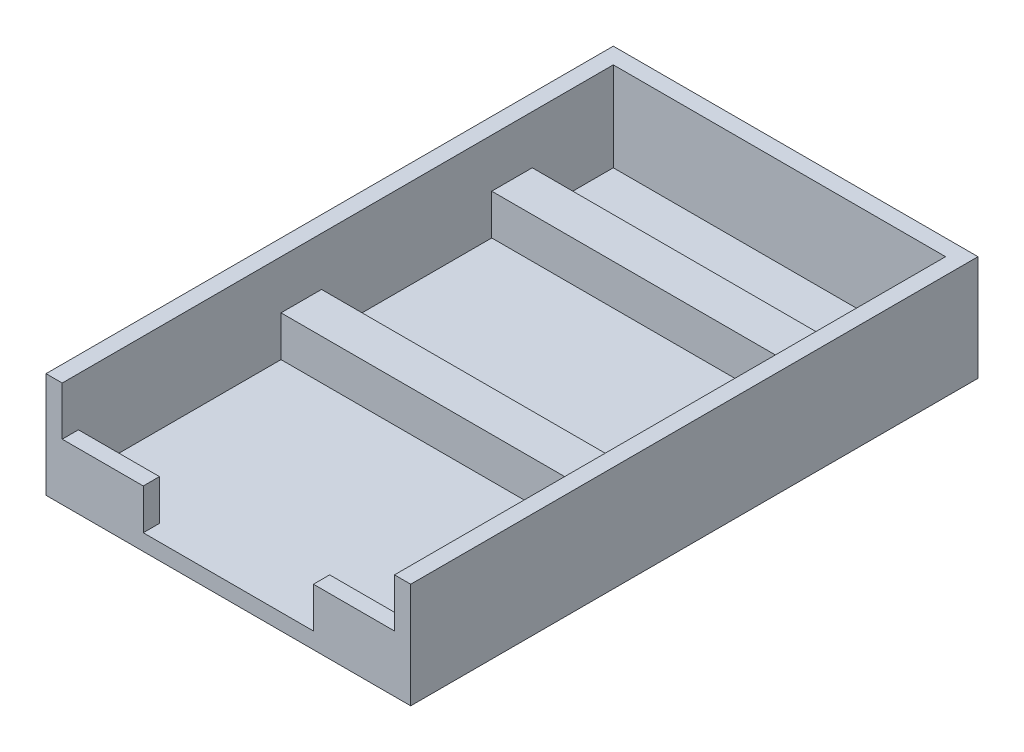
ISO-10303-21;
HEADER;
FILE_DESCRIPTION(('STEP AP214'),'2;1');
FILE_NAME('part.step','',(''),(''),'','','');
FILE_SCHEMA(('AUTOMOTIVE_DESIGN { 1 0 10303 214 1 1 1 1 }'));
ENDSEC;
DATA;
#1=APPLICATION_CONTEXT('core data for automotive mechanical design processes');
#2=APPLICATION_PROTOCOL_DEFINITION('international standard','automotive_design',2000,#1);
#3=PRODUCT_CONTEXT('',#1,'mechanical');
#4=PRODUCT('Part','Part','',(#3));
#5=PRODUCT_RELATED_PRODUCT_CATEGORY('part','',(#4));
#6=PRODUCT_DEFINITION_FORMATION('','',#4);
#7=PRODUCT_DEFINITION_CONTEXT('part definition',#1,'design');
#8=PRODUCT_DEFINITION('design','',#6,#7);
#9=PRODUCT_DEFINITION_SHAPE('','',#8);
#10=(LENGTH_UNIT() NAMED_UNIT(*) SI_UNIT(.MILLI.,.METRE.));
#11=(NAMED_UNIT(*) PLANE_ANGLE_UNIT() SI_UNIT($,.RADIAN.));
#12=(NAMED_UNIT(*) SI_UNIT($,.STERADIAN.) SOLID_ANGLE_UNIT());
#13=UNCERTAINTY_MEASURE_WITH_UNIT(LENGTH_MEASURE(1.E-05),#10,'distance_accuracy_value','');
#14=(GEOMETRIC_REPRESENTATION_CONTEXT(3) GLOBAL_UNCERTAINTY_ASSIGNED_CONTEXT((#13)) GLOBAL_UNIT_ASSIGNED_CONTEXT((#10,
#11,#12)) REPRESENTATION_CONTEXT('',''));
#15=CARTESIAN_POINT('',(0.,0.,0.));
#16=DIRECTION('',(0.,0.,1.));
#17=DIRECTION('',(1.,0.,0.));
#18=AXIS2_PLACEMENT_3D('',#15,#16,#17);
#19=CARTESIAN_POINT('',(-20.5,2.,-33.));
#20=DIRECTION('',(-1.,0.,0.));
#21=DIRECTION('',(0.,0.,1.));
#22=AXIS2_PLACEMENT_3D('',#19,#20,#21);
#23=PLANE('',#22);
#24=DIRECTION('',(0.,1.,0.));
#25=VECTOR('',#24,1.);
#26=CARTESIAN_POINT('',(-20.5,2.,-33.));
#27=LINE('',#26,#25);
#28=CARTESIAN_POINT('',(-20.5,2.,-33.));
#29=VERTEX_POINT('',#28);
#30=CARTESIAN_POINT('',(-20.5,13.,-33.));
#31=VERTEX_POINT('',#30);
#32=EDGE_CURVE('E337',#29,#31,#27,.T.);
#33=ORIENTED_EDGE('',*,*,#32,.T.);
#34=DIRECTION('',(0.,0.,-1.));
#35=VECTOR('',#34,1.);
#36=CARTESIAN_POINT('',(-20.5,13.,-35.));
#37=LINE('',#36,#35);
#38=CARTESIAN_POINT('',(-20.5,13.,35.));
#39=VERTEX_POINT('',#38);
#40=EDGE_CURVE('E232',#39,#31,#37,.T.);
#41=ORIENTED_EDGE('',*,*,#40,.F.);
#42=DIRECTION('',(0.,-1.,0.));
#43=VECTOR('',#42,1.);
#44=CARTESIAN_POINT('',(-20.5,10.,35.));
#45=LINE('',#44,#43);
#46=CARTESIAN_POINT('',(-20.5,7.,35.));
#47=VERTEX_POINT('',#46);
#48=EDGE_CURVE('E206',#39,#47,#45,.T.);
#49=ORIENTED_EDGE('',*,*,#48,.T.);
#50=DIRECTION('',(0.,0.,1.));
#51=VECTOR('',#50,1.);
#52=CARTESIAN_POINT('',(-20.5,7.,32.));
#53=LINE('',#52,#51);
#54=CARTESIAN_POINT('',(-20.5,7.,33.));
#55=VERTEX_POINT('',#54);
#56=EDGE_CURVE('E301',#55,#47,#53,.T.);
#57=ORIENTED_EDGE('',*,*,#56,.F.);
#58=DIRECTION('',(0.,1.,0.));
#59=VECTOR('',#58,1.);
#60=CARTESIAN_POINT('',(-20.5,2.,33.));
#61=LINE('',#60,#59);
#62=CARTESIAN_POINT('',(-20.5,2.,33.));
#63=VERTEX_POINT('',#62);
#64=EDGE_CURVE('E334',#63,#55,#61,.T.);
#65=ORIENTED_EDGE('',*,*,#64,.F.);
#66=DIRECTION('',(0.,0.,1.));
#67=VECTOR('',#66,1.);
#68=CARTESIAN_POINT('',(-20.5,2.,-33.));
#69=LINE('',#68,#67);
#70=CARTESIAN_POINT('',(-20.5,2.,7.99999999999999));
#71=VERTEX_POINT('',#70);
#72=EDGE_CURVE('E321',#71,#63,#69,.T.);
#73=ORIENTED_EDGE('',*,*,#72,.F.);
#74=DIRECTION('',(0.,-1.,0.));
#75=VECTOR('',#74,1.);
#76=CARTESIAN_POINT('',(-20.5,6.99999999999997,7.99999999999999));
#77=LINE('',#76,#75);
#78=CARTESIAN_POINT('',(-20.5,6.99999999999997,7.99999999999999));
#79=VERTEX_POINT('',#78);
#80=EDGE_CURVE('E64',#79,#71,#77,.T.);
#81=ORIENTED_EDGE('',*,*,#80,.F.);
#82=DIRECTION('',(0.,0.,1.));
#83=VECTOR('',#82,1.);
#84=CARTESIAN_POINT('',(-20.5,6.99999999999997,0.));
#85=LINE('',#84,#83);
#86=CARTESIAN_POINT('',(-20.5,6.99999999999997,2.99999999999999));
#87=VERTEX_POINT('',#86);
#88=EDGE_CURVE('E265',#87,#79,#85,.T.);
#89=ORIENTED_EDGE('',*,*,#88,.F.);
#90=DIRECTION('',(0.,-1.,0.));
#91=VECTOR('',#90,1.);
#92=CARTESIAN_POINT('',(-20.5,6.99999999999997,2.99999999999999));
#93=LINE('',#92,#91);
#94=CARTESIAN_POINT('',(-20.5,2.,2.99999999999999));
#95=VERTEX_POINT('',#94);
#96=EDGE_CURVE('E281',#87,#95,#93,.T.);
#97=ORIENTED_EDGE('',*,*,#96,.T.);
#98=CARTESIAN_POINT('',(-20.5,2.,-18.));
#99=VERTEX_POINT('',#98);
#100=EDGE_CURVE('E326',#99,#95,#69,.T.);
#101=ORIENTED_EDGE('',*,*,#100,.F.);
#102=DIRECTION('',(0.,-1.,0.));
#103=VECTOR('',#102,1.);
#104=CARTESIAN_POINT('',(-20.5,6.99999999999997,-18.));
#105=LINE('',#104,#103);
#106=CARTESIAN_POINT('',(-20.5,6.99999999999997,-18.));
#107=VERTEX_POINT('',#106);
#108=EDGE_CURVE('E56',#107,#99,#105,.T.);
#109=ORIENTED_EDGE('',*,*,#108,.F.);
#110=DIRECTION('',(0.,0.,1.));
#111=VECTOR('',#110,1.);
#112=CARTESIAN_POINT('',(-20.5,6.99999999999997,0.));
#113=LINE('',#112,#111);
#114=CARTESIAN_POINT('',(-20.5,6.99999999999997,-23.));
#115=VERTEX_POINT('',#114);
#116=EDGE_CURVE('E245',#115,#107,#113,.T.);
#117=ORIENTED_EDGE('',*,*,#116,.F.);
#118=DIRECTION('',(0.,-1.,0.));
#119=VECTOR('',#118,1.);
#120=CARTESIAN_POINT('',(-20.5,6.99999999999997,-23.));
#121=LINE('',#120,#119);
#122=CARTESIAN_POINT('',(-20.5,2.,-23.));
#123=VERTEX_POINT('',#122);
#124=EDGE_CURVE('E256',#115,#123,#121,.T.);
#125=ORIENTED_EDGE('',*,*,#124,.T.);
#126=EDGE_CURVE('E322',#29,#123,#69,.T.);
#127=ORIENTED_EDGE('',*,*,#126,.F.);
#128=EDGE_LOOP('',(#33,#41,#49,#57,#65,#73,#81,#89,#97,#101,#109,#117,#125,#127));
#129=FACE_BOUND('',#128,.T.);
#130=ADVANCED_FACE('F41',(#129),#23,.F.);
#131=CARTESIAN_POINT('',(0.,2.,0.));
#132=DIRECTION('',(0.,1.,0.));
#133=DIRECTION('',(0.,0.,1.));
#134=AXIS2_PLACEMENT_3D('',#131,#132,#133);
#135=PLANE('',#134);
#136=DIRECTION('',(0.,0.,-1.));
#137=VECTOR('',#136,1.);
#138=CARTESIAN_POINT('',(20.5,2.,-33.));
#139=LINE('',#138,#137);
#140=CARTESIAN_POINT('',(20.5,2.,2.99999999999999));
#141=VERTEX_POINT('',#140);
#142=CARTESIAN_POINT('',(20.5,2.,-18.));
#143=VERTEX_POINT('',#142);
#144=EDGE_CURVE('E318',#141,#143,#139,.T.);
#145=ORIENTED_EDGE('',*,*,#144,.T.);
#146=DIRECTION('',(1.,0.,0.));
#147=VECTOR('',#146,1.);
#148=CARTESIAN_POINT('',(0.,2.,-18.));
#149=LINE('',#148,#147);
#150=EDGE_CURVE('E242',#99,#143,#149,.T.);
#151=ORIENTED_EDGE('',*,*,#150,.F.);
#152=ORIENTED_EDGE('',*,*,#100,.T.);
#153=DIRECTION('',(1.,0.,0.));
#154=VECTOR('',#153,1.);
#155=CARTESIAN_POINT('',(0.,2.,2.99999999999999));
#156=LINE('',#155,#154);
#157=EDGE_CURVE('E261',#95,#141,#156,.T.);
#158=ORIENTED_EDGE('',*,*,#157,.T.);
#159=EDGE_LOOP('',(#145,#151,#152,#158));
#160=FACE_BOUND('',#159,.T.);
#161=ADVANCED_FACE('F379',(#160),#135,.T.);
#162=CARTESIAN_POINT('',(20.5,2.,33.));
#163=VERTEX_POINT('',#162);
#164=CARTESIAN_POINT('',(20.5,2.,7.99999999999999));
#165=VERTEX_POINT('',#164);
#166=EDGE_CURVE('E314',#163,#165,#139,.T.);
#167=ORIENTED_EDGE('',*,*,#166,.T.);
#168=DIRECTION('',(1.,0.,0.));
#169=VECTOR('',#168,1.);
#170=CARTESIAN_POINT('',(0.,2.,7.99999999999999));
#171=LINE('',#170,#169);
#172=EDGE_CURVE('E266',#71,#165,#171,.T.);
#173=ORIENTED_EDGE('',*,*,#172,.F.);
#174=ORIENTED_EDGE('',*,*,#72,.T.);
#175=DIRECTION('',(1.,0.,0.));
#176=VECTOR('',#175,1.);
#177=CARTESIAN_POINT('',(-20.5,2.,33.));
#178=LINE('',#177,#176);
#179=CARTESIAN_POINT('',(-10.5,2.,33.));
#180=VERTEX_POINT('',#179);
#181=EDGE_CURVE('E327',#63,#180,#178,.T.);
#182=ORIENTED_EDGE('',*,*,#181,.T.);
#183=DIRECTION('',(0.,0.,-1.));
#184=VECTOR('',#183,1.);
#185=CARTESIAN_POINT('',(-10.5,2.,75.));
#186=LINE('',#185,#184);
#187=CARTESIAN_POINT('',(-10.5,2.,35.));
#188=VERTEX_POINT('',#187);
#189=EDGE_CURVE('E290',#188,#180,#186,.T.);
#190=ORIENTED_EDGE('',*,*,#189,.F.);
#191=DIRECTION('',(-1.,0.,0.));
#192=VECTOR('',#191,1.);
#193=CARTESIAN_POINT('',(-22.5,2.,35.));
#194=LINE('',#193,#192);
#195=CARTESIAN_POINT('',(10.5,2.,35.));
#196=VERTEX_POINT('',#195);
#197=EDGE_CURVE('E298',#196,#188,#194,.T.);
#198=ORIENTED_EDGE('',*,*,#197,.F.);
#199=DIRECTION('',(0.,0.,-1.));
#200=VECTOR('',#199,1.);
#201=CARTESIAN_POINT('',(10.5,2.,75.));
#202=LINE('',#201,#200);
#203=CARTESIAN_POINT('',(10.5,2.,33.));
#204=VERTEX_POINT('',#203);
#205=EDGE_CURVE('E289',#196,#204,#202,.T.);
#206=ORIENTED_EDGE('',*,*,#205,.T.);
#207=EDGE_CURVE('E325',#204,#163,#178,.T.);
#208=ORIENTED_EDGE('',*,*,#207,.T.);
#209=EDGE_LOOP('',(#167,#173,#174,#182,#190,#198,#206,#208));
#210=FACE_BOUND('',#209,.T.);
#211=ADVANCED_FACE('F374',(#210),#135,.T.);
#212=CARTESIAN_POINT('',(-22.5,10.,35.));
#213=DIRECTION('',(0.,0.,-1.));
#214=DIRECTION('',(-1.,0.,0.));
#215=AXIS2_PLACEMENT_3D('',#212,#213,#214);
#216=PLANE('',#215);
#217=DIRECTION('',(0.,1.,0.));
#218=VECTOR('',#217,1.);
#219=CARTESIAN_POINT('',(10.5,10.,35.));
#220=LINE('',#219,#218);
#221=CARTESIAN_POINT('',(10.5,7.,35.));
#222=VERTEX_POINT('',#221);
#223=EDGE_CURVE('E296',#196,#222,#220,.T.);
#224=ORIENTED_EDGE('',*,*,#223,.F.);
#225=ORIENTED_EDGE('',*,*,#197,.T.);
#226=DIRECTION('',(0.,1.,0.));
#227=VECTOR('',#226,1.);
#228=CARTESIAN_POINT('',(-10.5,10.,35.));
#229=LINE('',#228,#227);
#230=CARTESIAN_POINT('',(-10.5,7.,35.));
#231=VERTEX_POINT('',#230);
#232=EDGE_CURVE('E292',#188,#231,#229,.T.);
#233=ORIENTED_EDGE('',*,*,#232,.T.);
#234=DIRECTION('',(1.,0.,0.));
#235=VECTOR('',#234,1.);
#236=CARTESIAN_POINT('',(-22.5,7.,35.));
#237=LINE('',#236,#235);
#238=EDGE_CURVE('E310',#47,#231,#237,.T.);
#239=ORIENTED_EDGE('',*,*,#238,.F.);
#240=ORIENTED_EDGE('',*,*,#48,.F.);
#241=DIRECTION('',(1.,0.,0.));
#242=VECTOR('',#241,1.);
#243=CARTESIAN_POINT('',(-22.5,13.,35.));
#244=LINE('',#243,#242);
#245=CARTESIAN_POINT('',(-22.5,13.,35.));
#246=VERTEX_POINT('',#245);
#247=EDGE_CURVE('E229',#246,#39,#244,.T.);
#248=ORIENTED_EDGE('',*,*,#247,.F.);
#249=DIRECTION('',(0.,-1.,0.));
#250=VECTOR('',#249,1.);
#251=CARTESIAN_POINT('',(-22.5,10.,35.));
#252=LINE('',#251,#250);
#253=CARTESIAN_POINT('',(-22.5,0.,35.));
#254=VERTEX_POINT('',#253);
#255=EDGE_CURVE('E349',#246,#254,#252,.T.);
#256=ORIENTED_EDGE('',*,*,#255,.T.);
#257=DIRECTION('',(1.,0.,0.));
#258=VECTOR('',#257,1.);
#259=CARTESIAN_POINT('',(-22.5,0.,35.));
#260=LINE('',#259,#258);
#261=CARTESIAN_POINT('',(22.5,0.,35.));
#262=VERTEX_POINT('',#261);
#263=EDGE_CURVE('E333',#254,#262,#260,.T.);
#264=ORIENTED_EDGE('',*,*,#263,.T.);
#265=DIRECTION('',(0.,-1.,0.));
#266=VECTOR('',#265,1.);
#267=CARTESIAN_POINT('',(22.5,10.,35.));
#268=LINE('',#267,#266);
#269=CARTESIAN_POINT('',(22.5,13.,35.));
#270=VERTEX_POINT('',#269);
#271=EDGE_CURVE('E221',#270,#262,#268,.T.);
#272=ORIENTED_EDGE('',*,*,#271,.F.);
#273=DIRECTION('',(1.,0.,0.));
#274=VECTOR('',#273,1.);
#275=CARTESIAN_POINT('',(20.5,13.,35.));
#276=LINE('',#275,#274);
#277=CARTESIAN_POINT('',(20.5,13.,35.));
#278=VERTEX_POINT('',#277);
#279=EDGE_CURVE('E213',#278,#270,#276,.T.);
#280=ORIENTED_EDGE('',*,*,#279,.F.);
#281=DIRECTION('',(0.,1.,0.));
#282=VECTOR('',#281,1.);
#283=CARTESIAN_POINT('',(20.5,10.,35.));
#284=LINE('',#283,#282);
#285=CARTESIAN_POINT('',(20.5,7.,35.));
#286=VERTEX_POINT('',#285);
#287=EDGE_CURVE('E193',#286,#278,#284,.T.);
#288=ORIENTED_EDGE('',*,*,#287,.F.);
#289=EDGE_CURVE('E309',#222,#286,#237,.T.);
#290=ORIENTED_EDGE('',*,*,#289,.F.);
#291=EDGE_LOOP('',(#224,#225,#233,#239,#240,#248,#256,#264,#272,#280,#288,#290));
#292=FACE_BOUND('',#291,.T.);
#293=ADVANCED_FACE('F43',(#292),#216,.F.);
#294=CARTESIAN_POINT('',(-20.5,2.,33.));
#295=DIRECTION('',(0.,0.,1.));
#296=DIRECTION('',(1.,0.,0.));
#297=AXIS2_PLACEMENT_3D('',#294,#295,#296);
#298=PLANE('',#297);
#299=DIRECTION('',(0.,1.,0.));
#300=VECTOR('',#299,1.);
#301=CARTESIAN_POINT('',(10.5,0.,33.));
#302=LINE('',#301,#300);
#303=CARTESIAN_POINT('',(10.5,7.,33.));
#304=VERTEX_POINT('',#303);
#305=EDGE_CURVE('E284',#204,#304,#302,.T.);
#306=ORIENTED_EDGE('',*,*,#305,.T.);
#307=DIRECTION('',(-1.,0.,0.));
#308=VECTOR('',#307,1.);
#309=CARTESIAN_POINT('',(-20.5,7.,33.));
#310=LINE('',#309,#308);
#311=CARTESIAN_POINT('',(20.5,7.,33.));
#312=VERTEX_POINT('',#311);
#313=EDGE_CURVE('E306',#312,#304,#310,.T.);
#314=ORIENTED_EDGE('',*,*,#313,.F.);
#315=DIRECTION('',(0.,1.,0.));
#316=VECTOR('',#315,1.);
#317=CARTESIAN_POINT('',(20.5,2.,33.));
#318=LINE('',#317,#316);
#319=EDGE_CURVE('E331',#163,#312,#318,.T.);
#320=ORIENTED_EDGE('',*,*,#319,.F.);
#321=ORIENTED_EDGE('',*,*,#207,.F.);
#322=EDGE_LOOP('',(#306,#314,#320,#321));
#323=FACE_BOUND('',#322,.T.);
#324=ADVANCED_FACE('F446',(#323),#298,.F.);
#325=CARTESIAN_POINT('',(0.,7.,32.));
#326=DIRECTION('',(0.,1.,0.));
#327=DIRECTION('',(0.,0.,1.));
#328=AXIS2_PLACEMENT_3D('',#325,#326,#327);
#329=PLANE('',#328);
#330=ORIENTED_EDGE('',*,*,#313,.T.);
#331=DIRECTION('',(0.,0.,1.));
#332=VECTOR('',#331,1.);
#333=CARTESIAN_POINT('',(10.5,7.,32.));
#334=LINE('',#333,#332);
#335=EDGE_CURVE('E11',#304,#222,#334,.T.);
#336=ORIENTED_EDGE('',*,*,#335,.T.);
#337=ORIENTED_EDGE('',*,*,#289,.T.);
#338=DIRECTION('',(0.,0.,1.));
#339=VECTOR('',#338,1.);
#340=CARTESIAN_POINT('',(20.5,7.,32.));
#341=LINE('',#340,#339);
#342=EDGE_CURVE('E201',#312,#286,#341,.T.);
#343=ORIENTED_EDGE('',*,*,#342,.F.);
#344=EDGE_LOOP('',(#330,#336,#337,#343));
#345=FACE_BOUND('',#344,.T.);
#346=ADVANCED_FACE('F445',(#345),#329,.T.);
#347=CARTESIAN_POINT('',(-10.5,7.,33.));
#348=VERTEX_POINT('',#347);
#349=EDGE_CURVE('E305',#348,#55,#310,.T.);
#350=ORIENTED_EDGE('',*,*,#349,.F.);
#351=DIRECTION('',(0.,1.,0.));
#352=VECTOR('',#351,1.);
#353=CARTESIAN_POINT('',(-10.5,0.,33.));
#354=LINE('',#353,#352);
#355=EDGE_CURVE('E287',#180,#348,#354,.T.);
#356=ORIENTED_EDGE('',*,*,#355,.F.);
#357=ORIENTED_EDGE('',*,*,#181,.F.);
#358=ORIENTED_EDGE('',*,*,#64,.T.);
#359=EDGE_LOOP('',(#350,#356,#357,#358));
#360=FACE_BOUND('',#359,.T.);
#361=ADVANCED_FACE('F372',(#360),#298,.F.);
#362=CARTESIAN_POINT('',(22.5,10.,-35.));
#363=DIRECTION('',(1.,0.,0.));
#364=DIRECTION('',(0.,0.,-1.));
#365=AXIS2_PLACEMENT_3D('',#362,#363,#364);
#366=PLANE('',#365);
#367=DIRECTION('',(0.,0.,1.));
#368=VECTOR('',#367,1.);
#369=CARTESIAN_POINT('',(22.5,0.,-35.));
#370=LINE('',#369,#368);
#371=CARTESIAN_POINT('',(22.5,0.,-35.));
#372=VERTEX_POINT('',#371);
#373=EDGE_CURVE('E341',#372,#262,#370,.T.);
#374=ORIENTED_EDGE('',*,*,#373,.F.);
#375=DIRECTION('',(0.,-1.,0.));
#376=VECTOR('',#375,1.);
#377=CARTESIAN_POINT('',(22.5,10.,-35.));
#378=LINE('',#377,#376);
#379=CARTESIAN_POINT('',(22.5,13.,-35.));
#380=VERTEX_POINT('',#379);
#381=EDGE_CURVE('E354',#380,#372,#378,.T.);
#382=ORIENTED_EDGE('',*,*,#381,.F.);
#383=DIRECTION('',(0.,0.,-1.));
#384=VECTOR('',#383,1.);
#385=CARTESIAN_POINT('',(22.5,13.,-35.));
#386=LINE('',#385,#384);
#387=EDGE_CURVE('E222',#270,#380,#386,.T.);
#388=ORIENTED_EDGE('',*,*,#387,.F.);
#389=ORIENTED_EDGE('',*,*,#271,.T.);
#390=EDGE_LOOP('',(#374,#382,#388,#389));
#391=FACE_BOUND('',#390,.T.);
#392=ADVANCED_FACE('F438',(#391),#366,.T.);
#393=CARTESIAN_POINT('',(-22.5,10.,-35.));
#394=DIRECTION('',(0.,0.,-1.));
#395=DIRECTION('',(-1.,0.,0.));
#396=AXIS2_PLACEMENT_3D('',#393,#394,#395);
#397=PLANE('',#396);
#398=DIRECTION('',(-1.,0.,0.));
#399=VECTOR('',#398,1.);
#400=CARTESIAN_POINT('',(-22.5,13.,-35.));
#401=LINE('',#400,#399);
#402=CARTESIAN_POINT('',(-22.5,13.,-35.));
#403=VERTEX_POINT('',#402);
#404=EDGE_CURVE('E234',#380,#403,#401,.T.);
#405=ORIENTED_EDGE('',*,*,#404,.F.);
#406=ORIENTED_EDGE('',*,*,#381,.T.);
#407=DIRECTION('',(1.,0.,0.));
#408=VECTOR('',#407,1.);
#409=CARTESIAN_POINT('',(-22.5,0.,-35.));
#410=LINE('',#409,#408);
#411=CARTESIAN_POINT('',(-22.5,0.,-35.));
#412=VERTEX_POINT('',#411);
#413=EDGE_CURVE('E344',#412,#372,#410,.T.);
#414=ORIENTED_EDGE('',*,*,#413,.F.);
#415=DIRECTION('',(0.,-1.,0.));
#416=VECTOR('',#415,1.);
#417=CARTESIAN_POINT('',(-22.5,10.,-35.));
#418=LINE('',#417,#416);
#419=EDGE_CURVE('E352',#403,#412,#418,.T.);
#420=ORIENTED_EDGE('',*,*,#419,.F.);
#421=EDGE_LOOP('',(#405,#406,#414,#420));
#422=FACE_BOUND('',#421,.T.);
#423=ADVANCED_FACE('F435',(#422),#397,.T.);
#424=CARTESIAN_POINT('',(-22.5,10.,-35.));
#425=DIRECTION('',(1.,0.,0.));
#426=DIRECTION('',(0.,0.,-1.));
#427=AXIS2_PLACEMENT_3D('',#424,#425,#426);
#428=PLANE('',#427);
#429=DIRECTION('',(0.,0.,1.));
#430=VECTOR('',#429,1.);
#431=CARTESIAN_POINT('',(-22.5,0.,-35.));
#432=LINE('',#431,#430);
#433=EDGE_CURVE('E347',#412,#254,#432,.T.);
#434=ORIENTED_EDGE('',*,*,#433,.T.);
#435=ORIENTED_EDGE('',*,*,#255,.F.);
#436=DIRECTION('',(0.,0.,1.));
#437=VECTOR('',#436,1.);
#438=CARTESIAN_POINT('',(-22.5,13.,-35.));
#439=LINE('',#438,#437);
#440=EDGE_CURVE('E227',#403,#246,#439,.T.);
#441=ORIENTED_EDGE('',*,*,#440,.F.);
#442=ORIENTED_EDGE('',*,*,#419,.T.);
#443=EDGE_LOOP('',(#434,#435,#441,#442));
#444=FACE_BOUND('',#443,.T.);
#445=ADVANCED_FACE('F432',(#444),#428,.F.);
#446=CARTESIAN_POINT('',(0.,0.,0.));
#447=DIRECTION('',(0.,-1.,0.));
#448=DIRECTION('',(0.,0.,-1.));
#449=AXIS2_PLACEMENT_3D('',#446,#447,#448);
#450=PLANE('',#449);
#451=ORIENTED_EDGE('',*,*,#263,.F.);
#452=ORIENTED_EDGE('',*,*,#433,.F.);
#453=ORIENTED_EDGE('',*,*,#413,.T.);
#454=ORIENTED_EDGE('',*,*,#373,.T.);
#455=EDGE_LOOP('',(#451,#452,#453,#454));
#456=FACE_BOUND('',#455,.T.);
#457=ADVANCED_FACE('F429',(#456),#450,.T.);
#458=CARTESIAN_POINT('',(20.5,2.,-33.));
#459=DIRECTION('',(1.,0.,0.));
#460=DIRECTION('',(0.,0.,-1.));
#461=AXIS2_PLACEMENT_3D('',#458,#459,#460);
#462=PLANE('',#461);
#463=CARTESIAN_POINT('',(20.5,2.,-23.));
#464=VERTEX_POINT('',#463);
#465=CARTESIAN_POINT('',(20.5,2.,-33.));
#466=VERTEX_POINT('',#465);
#467=EDGE_CURVE('E205',#464,#466,#139,.T.);
#468=ORIENTED_EDGE('',*,*,#467,.F.);
#469=DIRECTION('',(0.,-1.,0.));
#470=VECTOR('',#469,1.);
#471=CARTESIAN_POINT('',(20.5,6.99999999999997,-23.));
#472=LINE('',#471,#470);
#473=CARTESIAN_POINT('',(20.5,6.99999999999997,-23.));
#474=VERTEX_POINT('',#473);
#475=EDGE_CURVE('E259',#474,#464,#472,.T.);
#476=ORIENTED_EDGE('',*,*,#475,.F.);
#477=DIRECTION('',(0.,0.,1.));
#478=VECTOR('',#477,1.);
#479=CARTESIAN_POINT('',(20.5,6.99999999999997,0.));
#480=LINE('',#479,#478);
#481=CARTESIAN_POINT('',(20.5,6.99999999999997,-18.));
#482=VERTEX_POINT('',#481);
#483=EDGE_CURVE('E238',#474,#482,#480,.T.);
#484=ORIENTED_EDGE('',*,*,#483,.T.);
#485=DIRECTION('',(0.,-1.,0.));
#486=VECTOR('',#485,1.);
#487=CARTESIAN_POINT('',(20.5,6.99999999999997,-18.));
#488=LINE('',#487,#486);
#489=EDGE_CURVE('E249',#482,#143,#488,.T.);
#490=ORIENTED_EDGE('',*,*,#489,.T.);
#491=ORIENTED_EDGE('',*,*,#144,.F.);
#492=DIRECTION('',(0.,-1.,0.));
#493=VECTOR('',#492,1.);
#494=CARTESIAN_POINT('',(20.5,6.99999999999997,2.99999999999999));
#495=LINE('',#494,#493);
#496=CARTESIAN_POINT('',(20.5,6.99999999999997,2.99999999999999));
#497=VERTEX_POINT('',#496);
#498=EDGE_CURVE('E272',#497,#141,#495,.T.);
#499=ORIENTED_EDGE('',*,*,#498,.F.);
#500=DIRECTION('',(0.,0.,-1.));
#501=VECTOR('',#500,1.);
#502=CARTESIAN_POINT('',(20.5,6.99999999999997,0.));
#503=LINE('',#502,#501);
#504=CARTESIAN_POINT('',(20.5,6.99999999999997,7.99999999999999));
#505=VERTEX_POINT('',#504);
#506=EDGE_CURVE('E270',#505,#497,#503,.T.);
#507=ORIENTED_EDGE('',*,*,#506,.F.);
#508=DIRECTION('',(0.,-1.,0.));
#509=VECTOR('',#508,1.);
#510=CARTESIAN_POINT('',(20.5,6.99999999999997,7.99999999999999));
#511=LINE('',#510,#509);
#512=EDGE_CURVE('E277',#505,#165,#511,.T.);
#513=ORIENTED_EDGE('',*,*,#512,.T.);
#514=ORIENTED_EDGE('',*,*,#166,.F.);
#515=ORIENTED_EDGE('',*,*,#319,.T.);
#516=ORIENTED_EDGE('',*,*,#342,.T.);
#517=ORIENTED_EDGE('',*,*,#287,.T.);
#518=DIRECTION('',(0.,0.,1.));
#519=VECTOR('',#518,1.);
#520=CARTESIAN_POINT('',(20.5,13.,-35.));
#521=LINE('',#520,#519);
#522=CARTESIAN_POINT('',(20.5,13.,-33.));
#523=VERTEX_POINT('',#522);
#524=EDGE_CURVE('E198',#523,#278,#521,.T.);
#525=ORIENTED_EDGE('',*,*,#524,.F.);
#526=DIRECTION('',(0.,1.,0.));
#527=VECTOR('',#526,1.);
#528=CARTESIAN_POINT('',(20.5,2.,-33.));
#529=LINE('',#528,#527);
#530=EDGE_CURVE('E330',#466,#523,#529,.T.);
#531=ORIENTED_EDGE('',*,*,#530,.F.);
#532=EDGE_LOOP('',(#468,#476,#484,#490,#491,#499,#507,#513,#514,#515,#516,#517,#525,#531));
#533=FACE_BOUND('',#532,.T.);
#534=ADVANCED_FACE('F196',(#533),#462,.F.);
#535=CARTESIAN_POINT('',(-20.5,2.,-33.));
#536=DIRECTION('',(0.,0.,-1.));
#537=DIRECTION('',(-1.,0.,0.));
#538=AXIS2_PLACEMENT_3D('',#535,#536,#537);
#539=PLANE('',#538);
#540=ORIENTED_EDGE('',*,*,#530,.T.);
#541=DIRECTION('',(1.,0.,0.));
#542=VECTOR('',#541,1.);
#543=CARTESIAN_POINT('',(-20.5,13.,-33.));
#544=LINE('',#543,#542);
#545=EDGE_CURVE('E217',#31,#523,#544,.T.);
#546=ORIENTED_EDGE('',*,*,#545,.F.);
#547=ORIENTED_EDGE('',*,*,#32,.F.);
#548=DIRECTION('',(-1.,0.,0.));
#549=VECTOR('',#548,1.);
#550=CARTESIAN_POINT('',(-20.5,2.,-33.));
#551=LINE('',#550,#549);
#552=EDGE_CURVE('E317',#466,#29,#551,.T.);
#553=ORIENTED_EDGE('',*,*,#552,.F.);
#554=EDGE_LOOP('',(#540,#546,#547,#553));
#555=FACE_BOUND('',#554,.T.);
#556=ADVANCED_FACE('F398',(#555),#539,.F.);
#557=DIRECTION('',(1.,0.,0.));
#558=VECTOR('',#557,1.);
#559=CARTESIAN_POINT('',(0.,2.,-23.));
#560=LINE('',#559,#558);
#561=EDGE_CURVE('E237',#123,#464,#560,.T.);
#562=ORIENTED_EDGE('',*,*,#561,.T.);
#563=ORIENTED_EDGE('',*,*,#467,.T.);
#564=ORIENTED_EDGE('',*,*,#552,.T.);
#565=ORIENTED_EDGE('',*,*,#126,.T.);
#566=EDGE_LOOP('',(#562,#563,#564,#565));
#567=FACE_BOUND('',#566,.T.);
#568=ADVANCED_FACE('F394',(#567),#135,.T.);
#569=DIRECTION('',(0.,0.,1.));
#570=VECTOR('',#569,1.);
#571=CARTESIAN_POINT('',(-10.5,7.,32.));
#572=LINE('',#571,#570);
#573=EDGE_CURVE('E49',#348,#231,#572,.T.);
#574=ORIENTED_EDGE('',*,*,#573,.F.);
#575=ORIENTED_EDGE('',*,*,#349,.T.);
#576=ORIENTED_EDGE('',*,*,#56,.T.);
#577=ORIENTED_EDGE('',*,*,#238,.T.);
#578=EDGE_LOOP('',(#574,#575,#576,#577));
#579=FACE_BOUND('',#578,.T.);
#580=ADVANCED_FACE('F364',(#579),#329,.T.);
#581=CARTESIAN_POINT('',(10.5,0.,75.));
#582=DIRECTION('',(-1.,0.,0.));
#583=DIRECTION('',(0.,0.,1.));
#584=AXIS2_PLACEMENT_3D('',#581,#582,#583);
#585=PLANE('',#584);
#586=ORIENTED_EDGE('',*,*,#223,.T.);
#587=ORIENTED_EDGE('',*,*,#335,.F.);
#588=ORIENTED_EDGE('',*,*,#305,.F.);
#589=ORIENTED_EDGE('',*,*,#205,.F.);
#590=EDGE_LOOP('',(#586,#587,#588,#589));
#591=FACE_BOUND('',#590,.T.);
#592=ADVANCED_FACE('F470',(#591),#585,.T.);
#593=CARTESIAN_POINT('',(-10.5,0.,75.));
#594=DIRECTION('',(-1.,0.,0.));
#595=DIRECTION('',(0.,0.,1.));
#596=AXIS2_PLACEMENT_3D('',#593,#594,#595);
#597=PLANE('',#596);
#598=ORIENTED_EDGE('',*,*,#189,.T.);
#599=ORIENTED_EDGE('',*,*,#355,.T.);
#600=ORIENTED_EDGE('',*,*,#573,.T.);
#601=ORIENTED_EDGE('',*,*,#232,.F.);
#602=EDGE_LOOP('',(#598,#599,#600,#601));
#603=FACE_BOUND('',#602,.T.);
#604=ADVANCED_FACE('F358',(#603),#597,.F.);
#605=CARTESIAN_POINT('',(0.,6.99999999999997,2.99999999999999));
#606=DIRECTION('',(0.,0.,-1.));
#607=DIRECTION('',(-1.,0.,0.));
#608=AXIS2_PLACEMENT_3D('',#605,#606,#607);
#609=PLANE('',#608);
#610=ORIENTED_EDGE('',*,*,#157,.F.);
#611=ORIENTED_EDGE('',*,*,#96,.F.);
#612=DIRECTION('',(1.,0.,0.));
#613=VECTOR('',#612,1.);
#614=CARTESIAN_POINT('',(0.,6.99999999999997,2.99999999999999));
#615=LINE('',#614,#613);
#616=EDGE_CURVE('E262',#87,#497,#615,.T.);
#617=ORIENTED_EDGE('',*,*,#616,.T.);
#618=ORIENTED_EDGE('',*,*,#498,.T.);
#619=EDGE_LOOP('',(#610,#611,#617,#618));
#620=FACE_BOUND('',#619,.T.);
#621=ADVANCED_FACE('F382',(#620),#609,.T.);
#622=CARTESIAN_POINT('',(0.,6.99999999999997,7.99999999999999));
#623=DIRECTION('',(0.,0.,-1.));
#624=DIRECTION('',(-1.,0.,0.));
#625=AXIS2_PLACEMENT_3D('',#622,#623,#624);
#626=PLANE('',#625);
#627=ORIENTED_EDGE('',*,*,#172,.T.);
#628=ORIENTED_EDGE('',*,*,#512,.F.);
#629=DIRECTION('',(1.,0.,0.));
#630=VECTOR('',#629,1.);
#631=CARTESIAN_POINT('',(0.,6.99999999999997,7.99999999999999));
#632=LINE('',#631,#630);
#633=EDGE_CURVE('E268',#79,#505,#632,.T.);
#634=ORIENTED_EDGE('',*,*,#633,.F.);
#635=ORIENTED_EDGE('',*,*,#80,.T.);
#636=EDGE_LOOP('',(#627,#628,#634,#635));
#637=FACE_BOUND('',#636,.T.);
#638=ADVANCED_FACE('F389',(#637),#626,.F.);
#639=CARTESIAN_POINT('',(0.,6.99999999999997,0.));
#640=DIRECTION('',(0.,1.,0.));
#641=DIRECTION('',(0.,0.,1.));
#642=AXIS2_PLACEMENT_3D('',#639,#640,#641);
#643=PLANE('',#642);
#644=ORIENTED_EDGE('',*,*,#616,.F.);
#645=ORIENTED_EDGE('',*,*,#88,.T.);
#646=ORIENTED_EDGE('',*,*,#633,.T.);
#647=ORIENTED_EDGE('',*,*,#506,.T.);
#648=EDGE_LOOP('',(#644,#645,#646,#647));
#649=FACE_BOUND('',#648,.T.);
#650=ADVANCED_FACE('F387',(#649),#643,.T.);
#651=CARTESIAN_POINT('',(0.,6.99999999999997,-23.));
#652=DIRECTION('',(0.,0.,-1.));
#653=DIRECTION('',(-1.,0.,0.));
#654=AXIS2_PLACEMENT_3D('',#651,#652,#653);
#655=PLANE('',#654);
#656=ORIENTED_EDGE('',*,*,#561,.F.);
#657=ORIENTED_EDGE('',*,*,#124,.F.);
#658=DIRECTION('',(1.,0.,0.));
#659=VECTOR('',#658,1.);
#660=CARTESIAN_POINT('',(0.,6.99999999999997,-23.));
#661=LINE('',#660,#659);
#662=EDGE_CURVE('E241',#115,#474,#661,.T.);
#663=ORIENTED_EDGE('',*,*,#662,.T.);
#664=ORIENTED_EDGE('',*,*,#475,.T.);
#665=EDGE_LOOP('',(#656,#657,#663,#664));
#666=FACE_BOUND('',#665,.T.);
#667=ADVANCED_FACE('F403',(#666),#655,.T.);
#668=CARTESIAN_POINT('',(0.,6.99999999999997,-18.));
#669=DIRECTION('',(0.,0.,-1.));
#670=DIRECTION('',(-1.,0.,0.));
#671=AXIS2_PLACEMENT_3D('',#668,#669,#670);
#672=PLANE('',#671);
#673=ORIENTED_EDGE('',*,*,#150,.T.);
#674=ORIENTED_EDGE('',*,*,#489,.F.);
#675=DIRECTION('',(1.,0.,0.));
#676=VECTOR('',#675,1.);
#677=CARTESIAN_POINT('',(0.,6.99999999999997,-18.));
#678=LINE('',#677,#676);
#679=EDGE_CURVE('E247',#107,#482,#678,.T.);
#680=ORIENTED_EDGE('',*,*,#679,.F.);
#681=ORIENTED_EDGE('',*,*,#108,.T.);
#682=EDGE_LOOP('',(#673,#674,#680,#681));
#683=FACE_BOUND('',#682,.T.);
#684=ADVANCED_FACE('F406',(#683),#672,.F.);
#685=CARTESIAN_POINT('',(0.,6.99999999999997,0.));
#686=DIRECTION('',(0.,1.,0.));
#687=DIRECTION('',(0.,0.,1.));
#688=AXIS2_PLACEMENT_3D('',#685,#686,#687);
#689=PLANE('',#688);
#690=ORIENTED_EDGE('',*,*,#483,.F.);
#691=ORIENTED_EDGE('',*,*,#662,.F.);
#692=ORIENTED_EDGE('',*,*,#116,.T.);
#693=ORIENTED_EDGE('',*,*,#679,.T.);
#694=EDGE_LOOP('',(#690,#691,#692,#693));
#695=FACE_BOUND('',#694,.T.);
#696=ADVANCED_FACE('F405',(#695),#689,.T.);
#697=CARTESIAN_POINT('',(0.,13.,0.));
#698=DIRECTION('',(0.,1.,0.));
#699=DIRECTION('',(0.,0.,1.));
#700=AXIS2_PLACEMENT_3D('',#697,#698,#699);
#701=PLANE('',#700);
#702=ORIENTED_EDGE('',*,*,#440,.T.);
#703=ORIENTED_EDGE('',*,*,#247,.T.);
#704=ORIENTED_EDGE('',*,*,#40,.T.);
#705=ORIENTED_EDGE('',*,*,#545,.T.);
#706=ORIENTED_EDGE('',*,*,#524,.T.);
#707=ORIENTED_EDGE('',*,*,#279,.T.);
#708=ORIENTED_EDGE('',*,*,#387,.T.);
#709=ORIENTED_EDGE('',*,*,#404,.T.);
#710=EDGE_LOOP('',(#702,#703,#704,#705,#706,#707,#708,#709));
#711=FACE_BOUND('',#710,.T.);
#712=ADVANCED_FACE('F211',(#711),#701,.T.);
#713=CLOSED_SHELL('',(#130,#161,#211,#293,#324,#346,#361,#392,#423,#445,#457,#534,#556,#568,
#580,#592,#604,#621,#638,#650,#667,#684,#696,#712));
#714=MANIFOLD_SOLID_BREP('B2',#713);
#715=ADVANCED_BREP_SHAPE_REPRESENTATION('',(#18,#714),#14);
#716=SHAPE_DEFINITION_REPRESENTATION(#9,#715);
ENDSEC;
END-ISO-10303-21;
